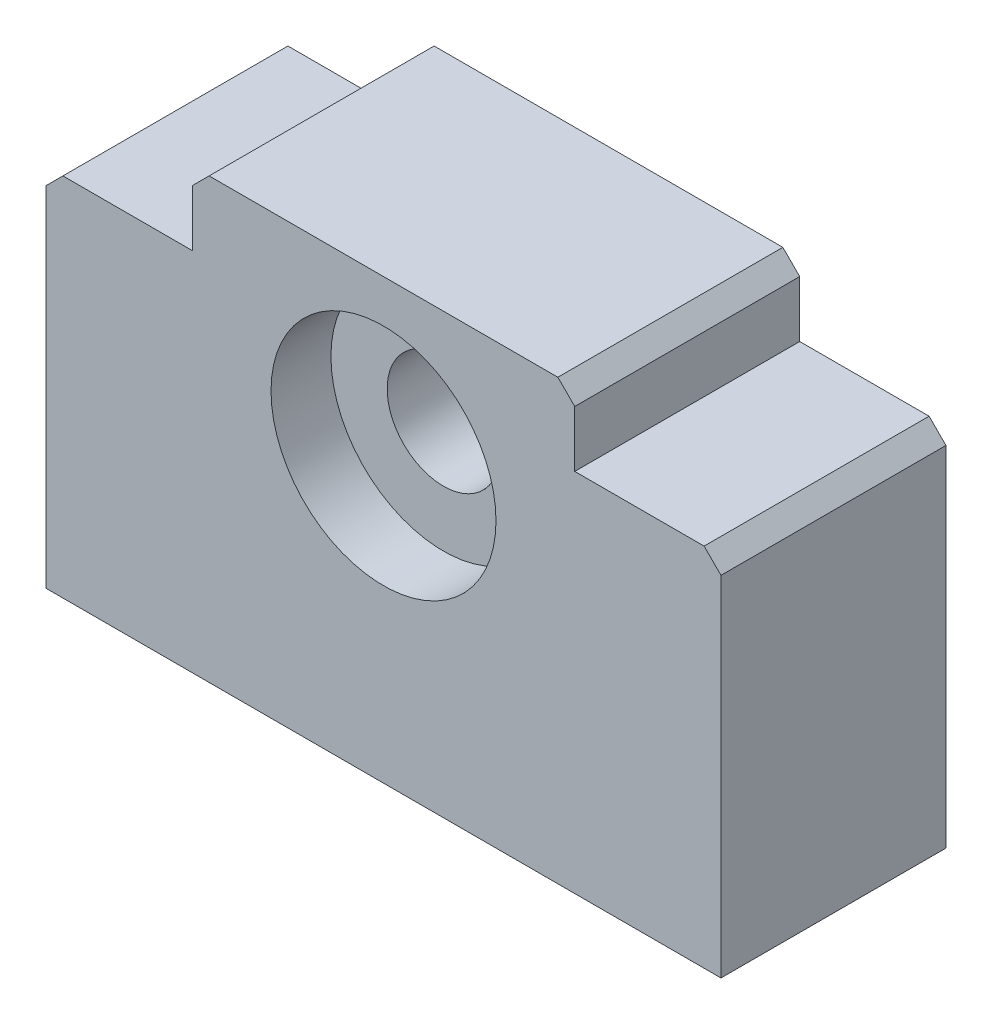
ISO-10303-21;
HEADER;
FILE_DESCRIPTION(('STEP AP214'),'2;1');
FILE_NAME('part.step','',(''),(''),'','','');
FILE_SCHEMA(('AUTOMOTIVE_DESIGN { 1 0 10303 214 1 1 1 1 }'));
ENDSEC;
DATA;
#1=APPLICATION_CONTEXT('core data for automotive mechanical design processes');
#2=APPLICATION_PROTOCOL_DEFINITION('international standard','automotive_design',2000,#1);
#3=PRODUCT_CONTEXT('',#1,'mechanical');
#4=PRODUCT('Part','Part','',(#3));
#5=PRODUCT_RELATED_PRODUCT_CATEGORY('part','',(#4));
#6=PRODUCT_DEFINITION_FORMATION('','',#4);
#7=PRODUCT_DEFINITION_CONTEXT('part definition',#1,'design');
#8=PRODUCT_DEFINITION('design','',#6,#7);
#9=PRODUCT_DEFINITION_SHAPE('','',#8);
#10=(LENGTH_UNIT() NAMED_UNIT(*) SI_UNIT(.MILLI.,.METRE.));
#11=(NAMED_UNIT(*) PLANE_ANGLE_UNIT() SI_UNIT($,.RADIAN.));
#12=(NAMED_UNIT(*) SI_UNIT($,.STERADIAN.) SOLID_ANGLE_UNIT());
#13=UNCERTAINTY_MEASURE_WITH_UNIT(LENGTH_MEASURE(1.E-05),#10,'distance_accuracy_value','');
#14=(GEOMETRIC_REPRESENTATION_CONTEXT(3) GLOBAL_UNCERTAINTY_ASSIGNED_CONTEXT((#13)) GLOBAL_UNIT_ASSIGNED_CONTEXT((#10,
#11,#12)) REPRESENTATION_CONTEXT('',''));
#15=CARTESIAN_POINT('',(0.,0.,0.));
#16=DIRECTION('',(0.,0.,1.));
#17=DIRECTION('',(1.,0.,0.));
#18=AXIS2_PLACEMENT_3D('',#15,#16,#17);
#19=CARTESIAN_POINT('',(0.,8.95,20.));
#20=DIRECTION('',(0.,0.,-1.));
#21=DIRECTION('',(-1.,0.,0.));
#22=AXIS2_PLACEMENT_3D('',#19,#20,#21);
#23=CYLINDRICAL_SURFACE('',#22,5.);
#24=CARTESIAN_POINT('',(0.,8.95,5.325));
#25=DIRECTION('',(0.,0.,1.));
#26=DIRECTION('',(1.,0.,0.));
#27=AXIS2_PLACEMENT_3D('',#24,#25,#26);
#28=CIRCLE('',#27,5.);
#29=CARTESIAN_POINT('',(5.,8.95,5.325));
#30=VERTEX_POINT('',#29);
#31=EDGE_CURVE('E179',#30,#30,#28,.T.);
#32=ORIENTED_EDGE('',*,*,#31,.F.);
#33=EDGE_LOOP('',(#32));
#34=FACE_BOUND('',#33,.T.);
#35=CARTESIAN_POINT('',(0.,8.95,14.675));
#36=DIRECTION('',(0.,0.,1.));
#37=DIRECTION('',(1.,0.,0.));
#38=AXIS2_PLACEMENT_3D('',#35,#36,#37);
#39=CIRCLE('',#38,5.);
#40=CARTESIAN_POINT('',(5.,8.95,14.675));
#41=VERTEX_POINT('',#40);
#42=EDGE_CURVE('E47',#41,#41,#39,.T.);
#43=ORIENTED_EDGE('',*,*,#42,.T.);
#44=EDGE_LOOP('',(#43));
#45=FACE_BOUND('',#44,.T.);
#46=ADVANCED_FACE('F42',(#34,#45),#23,.F.);
#47=CARTESIAN_POINT('',(30.,16.25,20.));
#48=DIRECTION('',(-1.,0.,0.));
#49=DIRECTION('',(0.,-1.,0.));
#50=AXIS2_PLACEMENT_3D('',#47,#48,#49);
#51=PLANE('',#50);
#52=DIRECTION('',(0.,1.,0.));
#53=VECTOR('',#52,1.);
#54=CARTESIAN_POINT('',(30.,16.25,0.));
#55=LINE('',#54,#53);
#56=CARTESIAN_POINT('',(30.,-16.25,0.));
#57=VERTEX_POINT('',#56);
#58=CARTESIAN_POINT('',(30.,14.75,0.));
#59=VERTEX_POINT('',#58);
#60=EDGE_CURVE('E176',#57,#59,#55,.T.);
#61=ORIENTED_EDGE('',*,*,#60,.T.);
#62=DIRECTION('',(0.,0.,1.));
#63=VECTOR('',#62,1.);
#64=CARTESIAN_POINT('',(30.,14.75,20.));
#65=LINE('',#64,#63);
#66=CARTESIAN_POINT('',(30.,14.75,20.));
#67=VERTEX_POINT('',#66);
#68=EDGE_CURVE('E210',#59,#67,#65,.T.);
#69=ORIENTED_EDGE('',*,*,#68,.T.);
#70=DIRECTION('',(0.,1.,0.));
#71=VECTOR('',#70,1.);
#72=CARTESIAN_POINT('',(30.,16.25,20.));
#73=LINE('',#72,#71);
#74=CARTESIAN_POINT('',(30.,-16.25,20.));
#75=VERTEX_POINT('',#74);
#76=EDGE_CURVE('E145',#75,#67,#73,.T.);
#77=ORIENTED_EDGE('',*,*,#76,.F.);
#78=DIRECTION('',(0.,0.,-1.));
#79=VECTOR('',#78,1.);
#80=CARTESIAN_POINT('',(30.,-16.25,20.));
#81=LINE('',#80,#79);
#82=EDGE_CURVE('E175',#75,#57,#81,.T.);
#83=ORIENTED_EDGE('',*,*,#82,.T.);
#84=EDGE_LOOP('',(#61,#69,#77,#83));
#85=FACE_BOUND('',#84,.T.);
#86=ADVANCED_FACE('F280',(#85),#51,.F.);
#87=CARTESIAN_POINT('',(17.,16.25,20.));
#88=DIRECTION('',(0.,-1.,0.));
#89=DIRECTION('',(0.,0.,-1.));
#90=AXIS2_PLACEMENT_3D('',#87,#88,#89);
#91=PLANE('',#90);
#92=DIRECTION('',(-1.,0.,0.));
#93=VECTOR('',#92,1.);
#94=CARTESIAN_POINT('',(17.,16.25,20.));
#95=LINE('',#94,#93);
#96=CARTESIAN_POINT('',(28.5,16.25,20.));
#97=VERTEX_POINT('',#96);
#98=CARTESIAN_POINT('',(17.,16.25,20.));
#99=VERTEX_POINT('',#98);
#100=EDGE_CURVE('E133',#97,#99,#95,.T.);
#101=ORIENTED_EDGE('',*,*,#100,.F.);
#102=DIRECTION('',(0.,0.,-1.));
#103=VECTOR('',#102,1.);
#104=CARTESIAN_POINT('',(28.5,16.25,20.));
#105=LINE('',#104,#103);
#106=CARTESIAN_POINT('',(28.5,16.25,0.));
#107=VERTEX_POINT('',#106);
#108=EDGE_CURVE('E155',#97,#107,#105,.T.);
#109=ORIENTED_EDGE('',*,*,#108,.T.);
#110=DIRECTION('',(-1.,0.,0.));
#111=VECTOR('',#110,1.);
#112=CARTESIAN_POINT('',(17.,16.25,0.));
#113=LINE('',#112,#111);
#114=CARTESIAN_POINT('',(17.,16.25,0.));
#115=VERTEX_POINT('',#114);
#116=EDGE_CURVE('E151',#107,#115,#113,.T.);
#117=ORIENTED_EDGE('',*,*,#116,.T.);
#118=DIRECTION('',(0.,0.,-1.));
#119=VECTOR('',#118,1.);
#120=CARTESIAN_POINT('',(17.,16.25,20.));
#121=LINE('',#120,#119);
#122=EDGE_CURVE('E148',#99,#115,#121,.T.);
#123=ORIENTED_EDGE('',*,*,#122,.F.);
#124=EDGE_LOOP('',(#101,#109,#117,#123));
#125=FACE_BOUND('',#124,.T.);
#126=ADVANCED_FACE('F149',(#125),#91,.F.);
#127=CARTESIAN_POINT('',(17.,22.75,20.));
#128=DIRECTION('',(-1.,0.,0.));
#129=DIRECTION('',(0.,0.,1.));
#130=AXIS2_PLACEMENT_3D('',#127,#128,#129);
#131=PLANE('',#130);
#132=DIRECTION('',(0.,1.,0.));
#133=VECTOR('',#132,1.);
#134=CARTESIAN_POINT('',(17.,22.75,0.));
#135=LINE('',#134,#133);
#136=CARTESIAN_POINT('',(17.,21.25,0.));
#137=VERTEX_POINT('',#136);
#138=EDGE_CURVE('E181',#115,#137,#135,.T.);
#139=ORIENTED_EDGE('',*,*,#138,.T.);
#140=DIRECTION('',(0.,0.,1.));
#141=VECTOR('',#140,1.);
#142=CARTESIAN_POINT('',(17.,21.25,20.));
#143=LINE('',#142,#141);
#144=CARTESIAN_POINT('',(17.,21.25,20.));
#145=VERTEX_POINT('',#144);
#146=EDGE_CURVE('E160',#137,#145,#143,.T.);
#147=ORIENTED_EDGE('',*,*,#146,.T.);
#148=DIRECTION('',(0.,1.,0.));
#149=VECTOR('',#148,1.);
#150=CARTESIAN_POINT('',(17.,22.75,20.));
#151=LINE('',#150,#149);
#152=EDGE_CURVE('E138',#99,#145,#151,.T.);
#153=ORIENTED_EDGE('',*,*,#152,.F.);
#154=ORIENTED_EDGE('',*,*,#122,.T.);
#155=EDGE_LOOP('',(#139,#147,#153,#154));
#156=FACE_BOUND('',#155,.T.);
#157=ADVANCED_FACE('F158',(#156),#131,.F.);
#158=CARTESIAN_POINT('',(-17.,22.75,20.));
#159=DIRECTION('',(0.,-1.,0.));
#160=DIRECTION('',(0.,0.,-1.));
#161=AXIS2_PLACEMENT_3D('',#158,#159,#160);
#162=PLANE('',#161);
#163=DIRECTION('',(-1.,0.,0.));
#164=VECTOR('',#163,1.);
#165=CARTESIAN_POINT('',(-17.,22.75,20.));
#166=LINE('',#165,#164);
#167=CARTESIAN_POINT('',(15.5,22.75,20.));
#168=VERTEX_POINT('',#167);
#169=CARTESIAN_POINT('',(-15.5,22.75,20.));
#170=VERTEX_POINT('',#169);
#171=EDGE_CURVE('E161',#168,#170,#166,.T.);
#172=ORIENTED_EDGE('',*,*,#171,.F.);
#173=DIRECTION('',(0.,0.,-1.));
#174=VECTOR('',#173,1.);
#175=CARTESIAN_POINT('',(15.5,22.75,20.));
#176=LINE('',#175,#174);
#177=CARTESIAN_POINT('',(15.5,22.75,0.));
#178=VERTEX_POINT('',#177);
#179=EDGE_CURVE('E220',#168,#178,#176,.T.);
#180=ORIENTED_EDGE('',*,*,#179,.T.);
#181=DIRECTION('',(-1.,0.,0.));
#182=VECTOR('',#181,1.);
#183=CARTESIAN_POINT('',(-17.,22.75,0.));
#184=LINE('',#183,#182);
#185=CARTESIAN_POINT('',(-15.5,22.75,0.));
#186=VERTEX_POINT('',#185);
#187=EDGE_CURVE('E183',#178,#186,#184,.T.);
#188=ORIENTED_EDGE('',*,*,#187,.T.);
#189=DIRECTION('',(0.,0.,1.));
#190=VECTOR('',#189,1.);
#191=CARTESIAN_POINT('',(-15.5,22.75,20.));
#192=LINE('',#191,#190);
#193=EDGE_CURVE('E218',#186,#170,#192,.T.);
#194=ORIENTED_EDGE('',*,*,#193,.T.);
#195=EDGE_LOOP('',(#172,#180,#188,#194));
#196=FACE_BOUND('',#195,.T.);
#197=ADVANCED_FACE('F259',(#196),#162,.F.);
#198=CARTESIAN_POINT('',(-17.,16.25,20.));
#199=DIRECTION('',(1.,0.,0.));
#200=DIRECTION('',(0.,0.,-1.));
#201=AXIS2_PLACEMENT_3D('',#198,#199,#200);
#202=PLANE('',#201);
#203=DIRECTION('',(0.,-1.,0.));
#204=VECTOR('',#203,1.);
#205=CARTESIAN_POINT('',(-17.,16.25,20.));
#206=LINE('',#205,#204);
#207=CARTESIAN_POINT('',(-17.,21.25,20.));
#208=VERTEX_POINT('',#207);
#209=CARTESIAN_POINT('',(-17.,16.25,20.));
#210=VERTEX_POINT('',#209);
#211=EDGE_CURVE('E164',#208,#210,#206,.T.);
#212=ORIENTED_EDGE('',*,*,#211,.F.);
#213=DIRECTION('',(0.,0.,-1.));
#214=VECTOR('',#213,1.);
#215=CARTESIAN_POINT('',(-17.,21.25,20.));
#216=LINE('',#215,#214);
#217=CARTESIAN_POINT('',(-17.,21.25,0.));
#218=VERTEX_POINT('',#217);
#219=EDGE_CURVE('E224',#208,#218,#216,.T.);
#220=ORIENTED_EDGE('',*,*,#219,.T.);
#221=DIRECTION('',(0.,-1.,0.));
#222=VECTOR('',#221,1.);
#223=CARTESIAN_POINT('',(-17.,16.25,0.));
#224=LINE('',#223,#222);
#225=CARTESIAN_POINT('',(-17.,16.25,0.));
#226=VERTEX_POINT('',#225);
#227=EDGE_CURVE('E186',#218,#226,#224,.T.);
#228=ORIENTED_EDGE('',*,*,#227,.T.);
#229=DIRECTION('',(0.,0.,-1.));
#230=VECTOR('',#229,1.);
#231=CARTESIAN_POINT('',(-17.,16.25,20.));
#232=LINE('',#231,#230);
#233=EDGE_CURVE('E156',#210,#226,#232,.T.);
#234=ORIENTED_EDGE('',*,*,#233,.F.);
#235=EDGE_LOOP('',(#212,#220,#228,#234));
#236=FACE_BOUND('',#235,.T.);
#237=ADVANCED_FACE('F267',(#236),#202,.F.);
#238=CARTESIAN_POINT('',(-30.,16.25,20.));
#239=DIRECTION('',(0.,-1.,0.));
#240=DIRECTION('',(0.,0.,-1.));
#241=AXIS2_PLACEMENT_3D('',#238,#239,#240);
#242=PLANE('',#241);
#243=DIRECTION('',(-1.,0.,0.));
#244=VECTOR('',#243,1.);
#245=CARTESIAN_POINT('',(-30.,16.25,0.));
#246=LINE('',#245,#244);
#247=CARTESIAN_POINT('',(-28.5,16.25,0.));
#248=VERTEX_POINT('',#247);
#249=EDGE_CURVE('E188',#226,#248,#246,.T.);
#250=ORIENTED_EDGE('',*,*,#249,.T.);
#251=DIRECTION('',(0.,0.,1.));
#252=VECTOR('',#251,1.);
#253=CARTESIAN_POINT('',(-28.5,16.25,20.));
#254=LINE('',#253,#252);
#255=CARTESIAN_POINT('',(-28.5,16.25,20.));
#256=VERTEX_POINT('',#255);
#257=EDGE_CURVE('E11',#248,#256,#254,.T.);
#258=ORIENTED_EDGE('',*,*,#257,.T.);
#259=DIRECTION('',(-1.,0.,0.));
#260=VECTOR('',#259,1.);
#261=CARTESIAN_POINT('',(-30.,16.25,20.));
#262=LINE('',#261,#260);
#263=EDGE_CURVE('E169',#210,#256,#262,.T.);
#264=ORIENTED_EDGE('',*,*,#263,.F.);
#265=ORIENTED_EDGE('',*,*,#233,.T.);
#266=EDGE_LOOP('',(#250,#258,#264,#265));
#267=FACE_BOUND('',#266,.T.);
#268=ADVANCED_FACE('F270',(#267),#242,.F.);
#269=CARTESIAN_POINT('',(-30.,16.25,20.));
#270=DIRECTION('',(1.,0.,0.));
#271=DIRECTION('',(0.,1.,0.));
#272=AXIS2_PLACEMENT_3D('',#269,#270,#271);
#273=PLANE('',#272);
#274=DIRECTION('',(0.,-1.,0.));
#275=VECTOR('',#274,1.);
#276=CARTESIAN_POINT('',(-30.,16.25,20.));
#277=LINE('',#276,#275);
#278=CARTESIAN_POINT('',(-30.,14.75,20.));
#279=VERTEX_POINT('',#278);
#280=CARTESIAN_POINT('',(-30.,-16.25,20.));
#281=VERTEX_POINT('',#280);
#282=EDGE_CURVE('E171',#279,#281,#277,.T.);
#283=ORIENTED_EDGE('',*,*,#282,.F.);
#284=DIRECTION('',(0.,0.,-1.));
#285=VECTOR('',#284,1.);
#286=CARTESIAN_POINT('',(-30.,14.75,20.));
#287=LINE('',#286,#285);
#288=CARTESIAN_POINT('',(-30.,14.75,0.));
#289=VERTEX_POINT('',#288);
#290=EDGE_CURVE('E52',#279,#289,#287,.T.);
#291=ORIENTED_EDGE('',*,*,#290,.T.);
#292=DIRECTION('',(0.,-1.,0.));
#293=VECTOR('',#292,1.);
#294=CARTESIAN_POINT('',(-30.,16.25,0.));
#295=LINE('',#294,#293);
#296=CARTESIAN_POINT('',(-30.,-16.25,0.));
#297=VERTEX_POINT('',#296);
#298=EDGE_CURVE('E190',#289,#297,#295,.T.);
#299=ORIENTED_EDGE('',*,*,#298,.T.);
#300=DIRECTION('',(0.,0.,-1.));
#301=VECTOR('',#300,1.);
#302=CARTESIAN_POINT('',(-30.,-16.25,20.));
#303=LINE('',#302,#301);
#304=EDGE_CURVE('E196',#281,#297,#303,.T.);
#305=ORIENTED_EDGE('',*,*,#304,.F.);
#306=EDGE_LOOP('',(#283,#291,#299,#305));
#307=FACE_BOUND('',#306,.T.);
#308=ADVANCED_FACE('F275',(#307),#273,.F.);
#309=CARTESIAN_POINT('',(-30.,-16.25,20.));
#310=DIRECTION('',(0.,1.,0.));
#311=DIRECTION('',(0.,0.,1.));
#312=AXIS2_PLACEMENT_3D('',#309,#310,#311);
#313=PLANE('',#312);
#314=DIRECTION('',(1.,0.,0.));
#315=VECTOR('',#314,1.);
#316=CARTESIAN_POINT('',(-30.,-16.25,0.));
#317=LINE('',#316,#315);
#318=EDGE_CURVE('E192',#297,#57,#317,.T.);
#319=ORIENTED_EDGE('',*,*,#318,.T.);
#320=ORIENTED_EDGE('',*,*,#82,.F.);
#321=DIRECTION('',(1.,0.,0.));
#322=VECTOR('',#321,1.);
#323=CARTESIAN_POINT('',(-30.,-16.25,20.));
#324=LINE('',#323,#322);
#325=EDGE_CURVE('E173',#281,#75,#324,.T.);
#326=ORIENTED_EDGE('',*,*,#325,.F.);
#327=ORIENTED_EDGE('',*,*,#304,.T.);
#328=EDGE_LOOP('',(#319,#320,#326,#327));
#329=FACE_BOUND('',#328,.T.);
#330=ADVANCED_FACE('F279',(#329),#313,.F.);
#331=CARTESIAN_POINT('',(0.,0.,20.));
#332=DIRECTION('',(0.,0.,1.));
#333=DIRECTION('',(1.,0.,0.));
#334=AXIS2_PLACEMENT_3D('',#331,#332,#333);
#335=PLANE('',#334);
#336=CARTESIAN_POINT('',(0.,8.95,20.));
#337=DIRECTION('',(0.,0.,1.));
#338=DIRECTION('',(1.,0.,0.));
#339=AXIS2_PLACEMENT_3D('',#336,#337,#338);
#340=CIRCLE('',#339,10.);
#341=CARTESIAN_POINT('',(10.,8.95,20.));
#342=VERTEX_POINT('',#341);
#343=EDGE_CURVE('E240',#342,#342,#340,.T.);
#344=ORIENTED_EDGE('',*,*,#343,.F.);
#345=EDGE_LOOP('',(#344));
#346=FACE_BOUND('',#345,.T.);
#347=ORIENTED_EDGE('',*,*,#76,.T.);
#348=DIRECTION('',(0.707106781186548,-0.707106781186548,0.));
#349=VECTOR('',#348,1.);
#350=CARTESIAN_POINT('',(22.375,22.375,20.));
#351=LINE('',#350,#349);
#352=EDGE_CURVE('E141',#67,#97,#351,.F.);
#353=ORIENTED_EDGE('',*,*,#352,.T.);
#354=ORIENTED_EDGE('',*,*,#100,.T.);
#355=ORIENTED_EDGE('',*,*,#152,.T.);
#356=DIRECTION('',(0.707106781186546,-0.707106781186549,0.));
#357=VECTOR('',#356,1.);
#358=CARTESIAN_POINT('',(19.125,19.1249999999999,20.));
#359=LINE('',#358,#357);
#360=EDGE_CURVE('E215',#145,#168,#359,.F.);
#361=ORIENTED_EDGE('',*,*,#360,.T.);
#362=ORIENTED_EDGE('',*,*,#171,.T.);
#363=DIRECTION('',(0.707106781186549,0.707106781186546,0.));
#364=VECTOR('',#363,1.);
#365=CARTESIAN_POINT('',(-19.125,19.125,20.));
#366=LINE('',#365,#364);
#367=EDGE_CURVE('E213',#170,#208,#366,.F.);
#368=ORIENTED_EDGE('',*,*,#367,.T.);
#369=ORIENTED_EDGE('',*,*,#211,.T.);
#370=ORIENTED_EDGE('',*,*,#263,.T.);
#371=DIRECTION('',(0.707106781186549,0.707106781186546,0.));
#372=VECTOR('',#371,1.);
#373=CARTESIAN_POINT('',(-22.3749999999999,22.375,20.));
#374=LINE('',#373,#372);
#375=EDGE_CURVE('E60',#256,#279,#374,.F.);
#376=ORIENTED_EDGE('',*,*,#375,.T.);
#377=ORIENTED_EDGE('',*,*,#282,.T.);
#378=ORIENTED_EDGE('',*,*,#325,.T.);
#379=EDGE_LOOP('',(#347,#353,#354,#355,#361,#362,#368,#369,#370,#376,#377,#378));
#380=FACE_BOUND('',#379,.T.);
#381=ADVANCED_FACE('F136',(#346,#380),#335,.T.);
#382=CARTESIAN_POINT('',(0.,0.,0.));
#383=DIRECTION('',(0.,0.,1.));
#384=DIRECTION('',(1.,0.,0.));
#385=AXIS2_PLACEMENT_3D('',#382,#383,#384);
#386=PLANE('',#385);
#387=CARTESIAN_POINT('',(0.,8.85195340541449,0.));
#388=DIRECTION('',(0.,0.,1.));
#389=DIRECTION('',(1.,0.,0.));
#390=AXIS2_PLACEMENT_3D('',#387,#388,#389);
#391=CIRCLE('',#390,10.);
#392=CARTESIAN_POINT('',(10.,8.85195340541449,0.));
#393=VERTEX_POINT('',#392);
#394=EDGE_CURVE('E233',#393,#393,#391,.T.);
#395=ORIENTED_EDGE('',*,*,#394,.T.);
#396=EDGE_LOOP('',(#395));
#397=FACE_BOUND('',#396,.T.);
#398=ORIENTED_EDGE('',*,*,#116,.F.);
#399=DIRECTION('',(-0.707106781186548,0.707106781186548,0.));
#400=VECTOR('',#399,1.);
#401=CARTESIAN_POINT('',(28.5,16.25,0.));
#402=LINE('',#401,#400);
#403=EDGE_CURVE('E208',#107,#59,#402,.F.);
#404=ORIENTED_EDGE('',*,*,#403,.T.);
#405=ORIENTED_EDGE('',*,*,#60,.F.);
#406=ORIENTED_EDGE('',*,*,#318,.F.);
#407=ORIENTED_EDGE('',*,*,#298,.F.);
#408=DIRECTION('',(-0.707106781186549,-0.707106781186546,0.));
#409=VECTOR('',#408,1.);
#410=CARTESIAN_POINT('',(-30.,14.75,0.));
#411=LINE('',#410,#409);
#412=EDGE_CURVE('E202',#289,#248,#411,.F.);
#413=ORIENTED_EDGE('',*,*,#412,.T.);
#414=ORIENTED_EDGE('',*,*,#249,.F.);
#415=ORIENTED_EDGE('',*,*,#227,.F.);
#416=DIRECTION('',(-0.707106781186549,-0.707106781186546,0.));
#417=VECTOR('',#416,1.);
#418=CARTESIAN_POINT('',(-17.,21.25,0.));
#419=LINE('',#418,#417);
#420=EDGE_CURVE('E204',#218,#186,#419,.F.);
#421=ORIENTED_EDGE('',*,*,#420,.T.);
#422=ORIENTED_EDGE('',*,*,#187,.F.);
#423=DIRECTION('',(-0.707106781186546,0.707106781186549,0.));
#424=VECTOR('',#423,1.);
#425=CARTESIAN_POINT('',(15.5,22.75,0.));
#426=LINE('',#425,#424);
#427=EDGE_CURVE('E206',#178,#137,#426,.F.);
#428=ORIENTED_EDGE('',*,*,#427,.T.);
#429=ORIENTED_EDGE('',*,*,#138,.F.);
#430=EDGE_LOOP('',(#398,#404,#405,#406,#407,#413,#414,#415,#421,#422,#428,#429));
#431=FACE_BOUND('',#430,.T.);
#432=ADVANCED_FACE('F250',(#397,#431),#386,.F.);
#433=CARTESIAN_POINT('',(28.5,16.25,20.));
#434=DIRECTION('',(-0.707106781186548,-0.707106781186548,0.));
#435=DIRECTION('',(0.,0.,-1.));
#436=AXIS2_PLACEMENT_3D('',#433,#434,#435);
#437=PLANE('',#436);
#438=ORIENTED_EDGE('',*,*,#352,.F.);
#439=ORIENTED_EDGE('',*,*,#68,.F.);
#440=ORIENTED_EDGE('',*,*,#403,.F.);
#441=ORIENTED_EDGE('',*,*,#108,.F.);
#442=EDGE_LOOP('',(#438,#439,#440,#441));
#443=FACE_BOUND('',#442,.T.);
#444=ADVANCED_FACE('F248',(#443),#437,.F.);
#445=CARTESIAN_POINT('',(15.5,22.75,20.));
#446=DIRECTION('',(-0.707106781186549,-0.707106781186546,0.));
#447=DIRECTION('',(0.,0.,-1.));
#448=AXIS2_PLACEMENT_3D('',#445,#446,#447);
#449=PLANE('',#448);
#450=ORIENTED_EDGE('',*,*,#360,.F.);
#451=ORIENTED_EDGE('',*,*,#146,.F.);
#452=ORIENTED_EDGE('',*,*,#427,.F.);
#453=ORIENTED_EDGE('',*,*,#179,.F.);
#454=EDGE_LOOP('',(#450,#451,#452,#453));
#455=FACE_BOUND('',#454,.T.);
#456=ADVANCED_FACE('F254',(#455),#449,.F.);
#457=CARTESIAN_POINT('',(-17.,21.25,20.));
#458=DIRECTION('',(0.707106781186546,-0.707106781186549,0.));
#459=DIRECTION('',(0.,0.,-1.));
#460=AXIS2_PLACEMENT_3D('',#457,#458,#459);
#461=PLANE('',#460);
#462=ORIENTED_EDGE('',*,*,#367,.F.);
#463=ORIENTED_EDGE('',*,*,#193,.F.);
#464=ORIENTED_EDGE('',*,*,#420,.F.);
#465=ORIENTED_EDGE('',*,*,#219,.F.);
#466=EDGE_LOOP('',(#462,#463,#464,#465));
#467=FACE_BOUND('',#466,.T.);
#468=ADVANCED_FACE('F262',(#467),#461,.F.);
#469=CARTESIAN_POINT('',(-30.,14.75,20.));
#470=DIRECTION('',(0.707106781186546,-0.707106781186549,0.));
#471=DIRECTION('',(0.,0.,-1.));
#472=AXIS2_PLACEMENT_3D('',#469,#470,#471);
#473=PLANE('',#472);
#474=ORIENTED_EDGE('',*,*,#375,.F.);
#475=ORIENTED_EDGE('',*,*,#257,.F.);
#476=ORIENTED_EDGE('',*,*,#412,.F.);
#477=ORIENTED_EDGE('',*,*,#290,.F.);
#478=EDGE_LOOP('',(#474,#475,#476,#477));
#479=FACE_BOUND('',#478,.T.);
#480=ADVANCED_FACE('F45',(#479),#473,.F.);
#481=CARTESIAN_POINT('',(0.,8.85195340541449,5.325));
#482=DIRECTION('',(0.,0.,-1.));
#483=DIRECTION('',(-1.,0.,0.));
#484=AXIS2_PLACEMENT_3D('',#481,#482,#483);
#485=CYLINDRICAL_SURFACE('',#484,10.);
#486=CARTESIAN_POINT('',(0.,8.85195340541449,5.325));
#487=DIRECTION('',(0.,0.,1.));
#488=DIRECTION('',(1.,0.,0.));
#489=AXIS2_PLACEMENT_3D('',#486,#487,#488);
#490=CIRCLE('',#489,10.);
#491=CARTESIAN_POINT('',(10.,8.85195340541449,5.325));
#492=VERTEX_POINT('',#491);
#493=EDGE_CURVE('E229',#492,#492,#490,.T.);
#494=ORIENTED_EDGE('',*,*,#493,.T.);
#495=EDGE_LOOP('',(#494));
#496=FACE_BOUND('',#495,.T.);
#497=ORIENTED_EDGE('',*,*,#394,.F.);
#498=EDGE_LOOP('',(#497));
#499=FACE_BOUND('',#498,.T.);
#500=ADVANCED_FACE('F308',(#496,#499),#485,.F.);
#501=CARTESIAN_POINT('',(0.,8.85195340541449,5.325));
#502=DIRECTION('',(0.,0.,1.));
#503=DIRECTION('',(1.,0.,0.));
#504=AXIS2_PLACEMENT_3D('',#501,#502,#503);
#505=PLANE('',#504);
#506=ORIENTED_EDGE('',*,*,#31,.T.);
#507=EDGE_LOOP('',(#506));
#508=FACE_BOUND('',#507,.T.);
#509=ORIENTED_EDGE('',*,*,#493,.F.);
#510=EDGE_LOOP('',(#509));
#511=FACE_BOUND('',#510,.T.);
#512=ADVANCED_FACE('F312',(#508,#511),#505,.F.);
#513=CARTESIAN_POINT('',(0.,8.95,14.675));
#514=DIRECTION('',(0.,0.,1.));
#515=DIRECTION('',(1.,0.,0.));
#516=AXIS2_PLACEMENT_3D('',#513,#514,#515);
#517=CYLINDRICAL_SURFACE('',#516,10.);
#518=CARTESIAN_POINT('',(0.,8.95,14.675));
#519=DIRECTION('',(0.,0.,1.));
#520=DIRECTION('',(1.,0.,0.));
#521=AXIS2_PLACEMENT_3D('',#518,#519,#520);
#522=CIRCLE('',#521,10.);
#523=CARTESIAN_POINT('',(10.,8.95,14.675));
#524=VERTEX_POINT('',#523);
#525=EDGE_CURVE('E428',#524,#524,#522,.T.);
#526=ORIENTED_EDGE('',*,*,#525,.F.);
#527=EDGE_LOOP('',(#526));
#528=FACE_BOUND('',#527,.T.);
#529=ORIENTED_EDGE('',*,*,#343,.T.);
#530=EDGE_LOOP('',(#529));
#531=FACE_BOUND('',#530,.T.);
#532=ADVANCED_FACE('F317',(#528,#531),#517,.F.);
#533=CARTESIAN_POINT('',(0.,8.95,14.675));
#534=DIRECTION('',(0.,0.,1.));
#535=DIRECTION('',(1.,0.,0.));
#536=AXIS2_PLACEMENT_3D('',#533,#534,#535);
#537=PLANE('',#536);
#538=ORIENTED_EDGE('',*,*,#42,.F.);
#539=EDGE_LOOP('',(#538));
#540=FACE_BOUND('',#539,.T.);
#541=ORIENTED_EDGE('',*,*,#525,.T.);
#542=EDGE_LOOP('',(#541));
#543=FACE_BOUND('',#542,.T.);
#544=ADVANCED_FACE('F410',(#540,#543),#537,.T.);
#545=CLOSED_SHELL('',(#46,#86,#126,#157,#197,#237,#268,#308,#330,#381,#432,#444,#456,#468,#480,
#500,#512,#532,#544));
#546=MANIFOLD_SOLID_BREP('B2',#545);
#547=ADVANCED_BREP_SHAPE_REPRESENTATION('',(#18,#546),#14);
#548=SHAPE_DEFINITION_REPRESENTATION(#9,#547);
ENDSEC;
END-ISO-10303-21;
